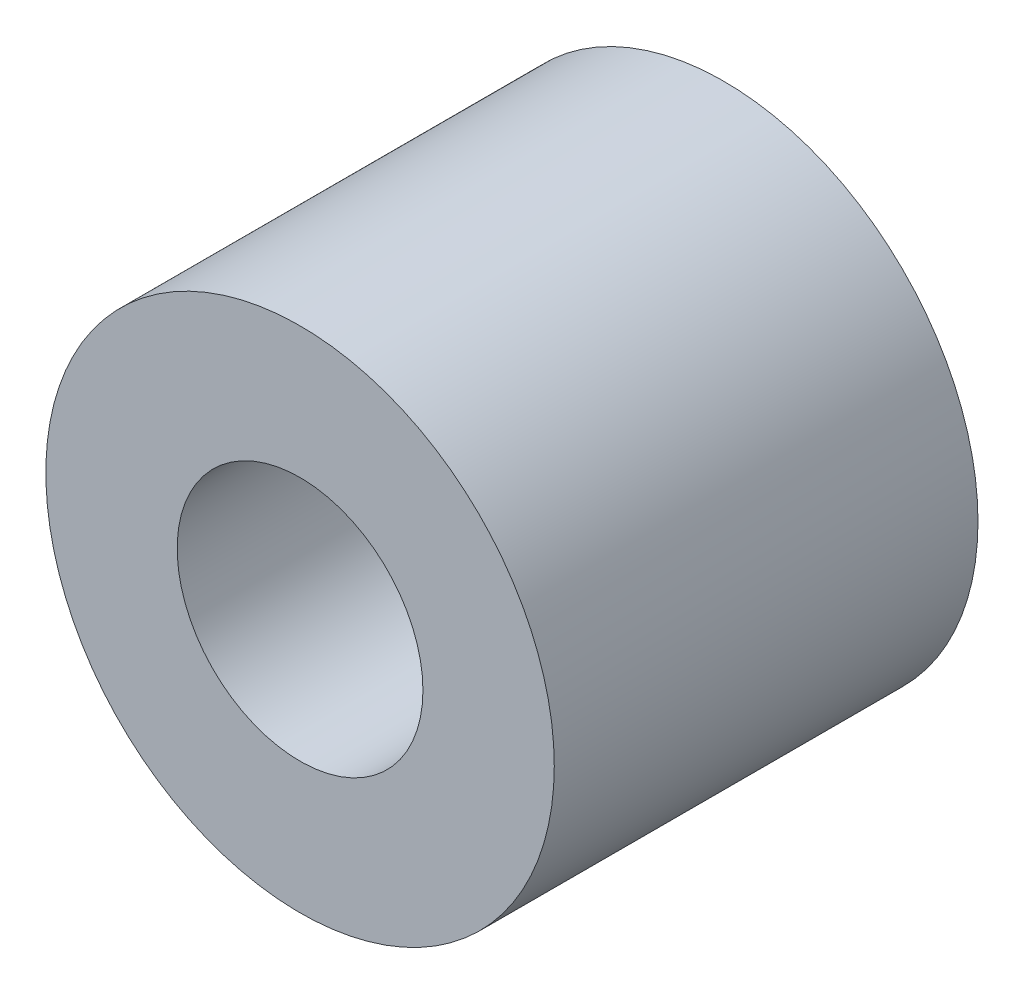
ISO-10303-21;
HEADER;
FILE_DESCRIPTION(('STEP AP214'),'2;1');
FILE_NAME('part.step','',(''),(''),'','','');
FILE_SCHEMA(('AUTOMOTIVE_DESIGN { 1 0 10303 214 1 1 1 1 }'));
ENDSEC;
DATA;
#1=APPLICATION_CONTEXT('core data for automotive mechanical design processes');
#2=APPLICATION_PROTOCOL_DEFINITION('international standard','automotive_design',2000,#1);
#3=PRODUCT_CONTEXT('',#1,'mechanical');
#4=PRODUCT('Part','Part','',(#3));
#5=PRODUCT_RELATED_PRODUCT_CATEGORY('part','',(#4));
#6=PRODUCT_DEFINITION_FORMATION('','',#4);
#7=PRODUCT_DEFINITION_CONTEXT('part definition',#1,'design');
#8=PRODUCT_DEFINITION('design','',#6,#7);
#9=PRODUCT_DEFINITION_SHAPE('','',#8);
#10=(LENGTH_UNIT() NAMED_UNIT(*) SI_UNIT(.MILLI.,.METRE.));
#11=(NAMED_UNIT(*) PLANE_ANGLE_UNIT() SI_UNIT($,.RADIAN.));
#12=(NAMED_UNIT(*) SI_UNIT($,.STERADIAN.) SOLID_ANGLE_UNIT());
#13=UNCERTAINTY_MEASURE_WITH_UNIT(LENGTH_MEASURE(1.E-05),#10,'distance_accuracy_value','');
#14=(GEOMETRIC_REPRESENTATION_CONTEXT(3) GLOBAL_UNCERTAINTY_ASSIGNED_CONTEXT((#13)) GLOBAL_UNIT_ASSIGNED_CONTEXT((#10,
#11,#12)) REPRESENTATION_CONTEXT('',''));
#15=CARTESIAN_POINT('',(0.,0.,0.));
#16=DIRECTION('',(0.,0.,1.));
#17=DIRECTION('',(1.,0.,0.));
#18=AXIS2_PLACEMENT_3D('',#15,#16,#17);
#19=CARTESIAN_POINT('',(0.,0.,5.));
#20=DIRECTION('',(0.,0.,1.));
#21=DIRECTION('',(1.,0.,0.));
#22=AXIS2_PLACEMENT_3D('',#19,#20,#21);
#23=PLANE('',#22);
#24=CARTESIAN_POINT('',(0.,0.,5.));
#25=DIRECTION('',(0.,0.,1.));
#26=DIRECTION('',(1.,0.,0.));
#27=AXIS2_PLACEMENT_3D('',#24,#25,#26);
#28=CIRCLE('',#27,3.);
#29=CARTESIAN_POINT('',(3.,0.,5.));
#30=VERTEX_POINT('',#29);
#31=EDGE_CURVE('E10',#30,#30,#28,.T.);
#32=ORIENTED_EDGE('',*,*,#31,.T.);
#33=EDGE_LOOP('',(#32));
#34=FACE_BOUND('',#33,.T.);
#35=CARTESIAN_POINT('',(0.,0.,5.));
#36=DIRECTION('',(0.,0.,1.));
#37=DIRECTION('',(1.,0.,0.));
#38=AXIS2_PLACEMENT_3D('',#35,#36,#37);
#39=CIRCLE('',#38,1.45);
#40=CARTESIAN_POINT('',(1.45,0.,5.));
#41=VERTEX_POINT('',#40);
#42=EDGE_CURVE('E42',#41,#41,#39,.T.);
#43=ORIENTED_EDGE('',*,*,#42,.F.);
#44=EDGE_LOOP('',(#43));
#45=FACE_BOUND('',#44,.T.);
#46=ADVANCED_FACE('F31',(#34,#45),#23,.T.);
#47=CARTESIAN_POINT('',(0.,0.,0.));
#48=DIRECTION('',(0.,0.,1.));
#49=DIRECTION('',(1.,0.,0.));
#50=AXIS2_PLACEMENT_3D('',#47,#48,#49);
#51=PLANE('',#50);
#52=CARTESIAN_POINT('',(0.,0.,0.));
#53=DIRECTION('',(0.,0.,1.));
#54=DIRECTION('',(1.,0.,0.));
#55=AXIS2_PLACEMENT_3D('',#52,#53,#54);
#56=CIRCLE('',#55,3.);
#57=CARTESIAN_POINT('',(3.,0.,0.));
#58=VERTEX_POINT('',#57);
#59=EDGE_CURVE('E35',#58,#58,#56,.T.);
#60=ORIENTED_EDGE('',*,*,#59,.F.);
#61=EDGE_LOOP('',(#60));
#62=FACE_BOUND('',#61,.T.);
#63=CARTESIAN_POINT('',(0.,0.,0.));
#64=DIRECTION('',(0.,0.,1.));
#65=DIRECTION('',(1.,0.,0.));
#66=AXIS2_PLACEMENT_3D('',#63,#64,#65);
#67=CIRCLE('',#66,1.45);
#68=CARTESIAN_POINT('',(1.45,0.,0.));
#69=VERTEX_POINT('',#68);
#70=EDGE_CURVE('E44',#69,#69,#67,.T.);
#71=ORIENTED_EDGE('',*,*,#70,.T.);
#72=EDGE_LOOP('',(#71));
#73=FACE_BOUND('',#72,.T.);
#74=ADVANCED_FACE('F54',(#62,#73),#51,.F.);
#75=CARTESIAN_POINT('',(0.,0.,5.));
#76=DIRECTION('',(0.,0.,-1.));
#77=DIRECTION('',(-1.,0.,0.));
#78=AXIS2_PLACEMENT_3D('',#75,#76,#77);
#79=CYLINDRICAL_SURFACE('',#78,3.);
#80=ORIENTED_EDGE('',*,*,#31,.F.);
#81=EDGE_LOOP('',(#80));
#82=FACE_BOUND('',#81,.T.);
#83=ORIENTED_EDGE('',*,*,#59,.T.);
#84=EDGE_LOOP('',(#83));
#85=FACE_BOUND('',#84,.T.);
#86=ADVANCED_FACE('F33',(#82,#85),#79,.T.);
#87=CARTESIAN_POINT('',(0.,0.,5.));
#88=DIRECTION('',(0.,0.,-1.));
#89=DIRECTION('',(-1.,0.,0.));
#90=AXIS2_PLACEMENT_3D('',#87,#88,#89);
#91=CYLINDRICAL_SURFACE('',#90,1.45);
#92=ORIENTED_EDGE('',*,*,#42,.T.);
#93=EDGE_LOOP('',(#92));
#94=FACE_BOUND('',#93,.T.);
#95=ORIENTED_EDGE('',*,*,#70,.F.);
#96=EDGE_LOOP('',(#95));
#97=FACE_BOUND('',#96,.T.);
#98=ADVANCED_FACE('F50',(#94,#97),#91,.F.);
#99=CLOSED_SHELL('',(#46,#74,#86,#98));
#100=MANIFOLD_SOLID_BREP('B2',#99);
#101=ADVANCED_BREP_SHAPE_REPRESENTATION('',(#18,#100),#14);
#102=SHAPE_DEFINITION_REPRESENTATION(#9,#101);
ENDSEC;
END-ISO-10303-21;
